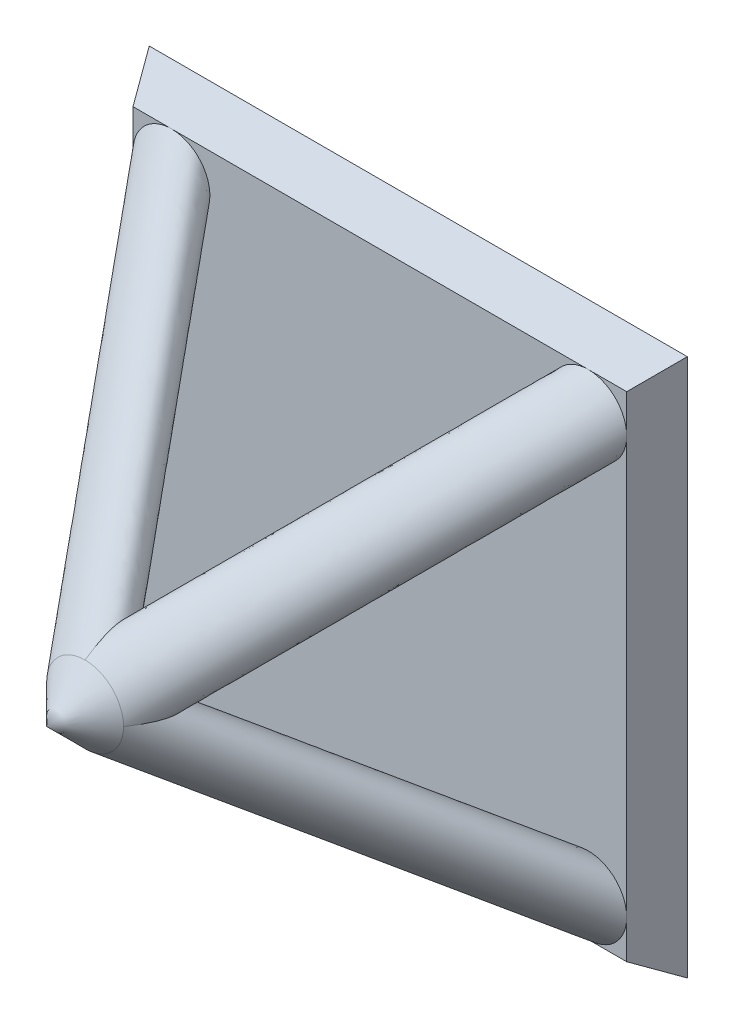
ISO-10303-21;
HEADER;
FILE_DESCRIPTION(('STEP AP214'),'2;1');
FILE_NAME('part.step','',(''),(''),'','','');
FILE_SCHEMA(('AUTOMOTIVE_DESIGN { 1 0 10303 214 1 1 1 1 }'));
ENDSEC;
DATA;
#1=APPLICATION_CONTEXT('core data for automotive mechanical design processes');
#2=APPLICATION_PROTOCOL_DEFINITION('international standard','automotive_design',2000,#1);
#3=PRODUCT_CONTEXT('',#1,'mechanical');
#4=PRODUCT('Part','Part','',(#3));
#5=PRODUCT_RELATED_PRODUCT_CATEGORY('part','',(#4));
#6=PRODUCT_DEFINITION_FORMATION('','',#4);
#7=PRODUCT_DEFINITION_CONTEXT('part definition',#1,'design');
#8=PRODUCT_DEFINITION('design','',#6,#7);
#9=PRODUCT_DEFINITION_SHAPE('','',#8);
#10=(LENGTH_UNIT() NAMED_UNIT(*) SI_UNIT(.MILLI.,.METRE.));
#11=(NAMED_UNIT(*) PLANE_ANGLE_UNIT() SI_UNIT($,.RADIAN.));
#12=(NAMED_UNIT(*) SI_UNIT($,.STERADIAN.) SOLID_ANGLE_UNIT());
#13=UNCERTAINTY_MEASURE_WITH_UNIT(LENGTH_MEASURE(1.E-05),#10,'distance_accuracy_value','');
#14=(GEOMETRIC_REPRESENTATION_CONTEXT(3) GLOBAL_UNCERTAINTY_ASSIGNED_CONTEXT((#13)) GLOBAL_UNIT_ASSIGNED_CONTEXT((#10,
#11,#12)) REPRESENTATION_CONTEXT('',''));
#15=CARTESIAN_POINT('',(0.,0.,0.));
#16=DIRECTION('',(0.,0.,1.));
#17=DIRECTION('',(1.,0.,0.));
#18=AXIS2_PLACEMENT_3D('',#15,#16,#17);
#19=CARTESIAN_POINT('',(0.,0.,1.43977497796458));
#20=DIRECTION('',(0.,0.,1.));
#21=DIRECTION('',(1.,0.,0.));
#22=AXIS2_PLACEMENT_3D('',#19,#20,#21);
#23=PLANE('',#22);
#24=DIRECTION('',(-1.,0.,0.));
#25=VECTOR('',#24,1.);
#26=CARTESIAN_POINT('',(-3.5,-3.21132486540519,1.43977497796458));
#27=LINE('',#26,#25);
#28=CARTESIAN_POINT('',(-2.71132486540518,-3.21132486540519,1.43977497796458));
#29=VERTEX_POINT('',#28);
#30=CARTESIAN_POINT('',(2.71132486540522,-3.21132486540519,1.43977497796458));
#31=VERTEX_POINT('',#30);
#32=EDGE_CURVE('E255',#29,#31,#27,.F.);
#33=ORIENTED_EDGE('',*,*,#32,.T.);
#34=CARTESIAN_POINT('',(2.71132486540522,-2.71132486540516,1.43977497796458));
#35=DIRECTION('',(0.,0.,1.));
#36=DIRECTION('',(0.,-1.,0.));
#37=AXIS2_PLACEMENT_3D('',#34,#35,#36);
#38=CIRCLE('',#37,0.5);
#39=CARTESIAN_POINT('',(3.21132486540519,-2.71132486540516,1.43977497796458));
#40=VERTEX_POINT('',#39);
#41=EDGE_CURVE('E53',#40,#31,#38,.T.);
#42=ORIENTED_EDGE('',*,*,#41,.F.);
#43=DIRECTION('',(0.,-1.,0.));
#44=VECTOR('',#43,1.);
#45=CARTESIAN_POINT('',(3.21132486540519,3.49999999999999,1.43977497796458));
#46=LINE('',#45,#44);
#47=CARTESIAN_POINT('',(3.21132486540519,2.71132486540518,1.43977497796458));
#48=VERTEX_POINT('',#47);
#49=EDGE_CURVE('E260',#40,#48,#46,.F.);
#50=ORIENTED_EDGE('',*,*,#49,.T.);
#51=CARTESIAN_POINT('',(2.71132486540519,2.71132486540518,1.43977497796458));
#52=DIRECTION('',(0.,0.,1.));
#53=DIRECTION('',(1.,0.,0.));
#54=AXIS2_PLACEMENT_3D('',#51,#52,#53);
#55=CIRCLE('',#54,0.5);
#56=CARTESIAN_POINT('',(2.71132486540519,3.21132486540518,1.43977497796458));
#57=VERTEX_POINT('',#56);
#58=EDGE_CURVE('E151',#57,#48,#55,.T.);
#59=ORIENTED_EDGE('',*,*,#58,.F.);
#60=DIRECTION('',(1.,0.,0.));
#61=VECTOR('',#60,1.);
#62=CARTESIAN_POINT('',(-3.5,3.21132486540518,1.43977497796458));
#63=LINE('',#62,#61);
#64=CARTESIAN_POINT('',(-2.71132486540519,3.21132486540518,1.43977497796458));
#65=VERTEX_POINT('',#64);
#66=EDGE_CURVE('E261',#57,#65,#63,.F.);
#67=ORIENTED_EDGE('',*,*,#66,.T.);
#68=CARTESIAN_POINT('',(-2.71132486540519,2.71132486540517,1.43977497796458));
#69=DIRECTION('',(0.,0.,1.));
#70=DIRECTION('',(0.,1.,0.));
#71=AXIS2_PLACEMENT_3D('',#68,#69,#70);
#72=CIRCLE('',#71,0.5);
#73=CARTESIAN_POINT('',(-3.21132486540519,2.71132486540517,1.43977497796458));
#74=VERTEX_POINT('',#73);
#75=EDGE_CURVE('E173',#74,#65,#72,.T.);
#76=ORIENTED_EDGE('',*,*,#75,.F.);
#77=DIRECTION('',(0.,1.,0.));
#78=VECTOR('',#77,1.);
#79=CARTESIAN_POINT('',(-3.21132486540518,3.49999999999999,1.43977497796458));
#80=LINE('',#79,#78);
#81=CARTESIAN_POINT('',(-3.21132486540518,-2.71132486540519,1.43977497796458));
#82=VERTEX_POINT('',#81);
#83=EDGE_CURVE('E251',#74,#82,#80,.F.);
#84=ORIENTED_EDGE('',*,*,#83,.T.);
#85=CARTESIAN_POINT('',(-2.71132486540518,-2.71132486540519,1.43977497796458));
#86=DIRECTION('',(0.,0.,1.));
#87=DIRECTION('',(-1.,0.,0.));
#88=AXIS2_PLACEMENT_3D('',#85,#86,#87);
#89=CIRCLE('',#88,0.5);
#90=EDGE_CURVE('E60',#29,#82,#89,.T.);
#91=ORIENTED_EDGE('',*,*,#90,.F.);
#92=EDGE_LOOP('',(#33,#42,#50,#59,#67,#76,#84,#91));
#93=FACE_BOUND('',#92,.T.);
#94=ADVANCED_FACE('F34',(#93),#23,.T.);
#95=CARTESIAN_POINT('',(3.21132486540519,-3.21132486540519,1.43977497796458));
#96=VERTEX_POINT('',#95);
#97=EDGE_CURVE('E256',#96,#40,#46,.F.);
#98=ORIENTED_EDGE('',*,*,#97,.T.);
#99=EDGE_CURVE('E180',#31,#40,#38,.T.);
#100=ORIENTED_EDGE('',*,*,#99,.F.);
#101=EDGE_CURVE('E250',#31,#96,#27,.F.);
#102=ORIENTED_EDGE('',*,*,#101,.T.);
#103=EDGE_LOOP('',(#98,#100,#102));
#104=FACE_BOUND('',#103,.T.);
#105=ADVANCED_FACE('F195',(#104),#23,.T.);
#106=CARTESIAN_POINT('',(0.,0.,5.2741673746201));
#107=DIRECTION('',(0.,0.,1.));
#108=DIRECTION('',(1.,0.,0.));
#109=AXIS2_PLACEMENT_3D('',#106,#107,#108);
#110=CIRCLE('',#109,0.5);
#111=DIRECTION('',(0.499999999999994,0.499999999999994,-0.707106781186556));
#112=VECTOR('',#111,1.);
#113=SURFACE_OF_LINEAR_EXTRUSION('',#110,#112);
#114=EDGE_CURVE('E135',#48,#57,#55,.T.);
#115=ORIENTED_EDGE('',*,*,#114,.T.);
#116=ORIENTED_EDGE('',*,*,#58,.T.);
#117=EDGE_LOOP('',(#115,#116));
#118=FACE_BOUND('',#117,.T.);
#119=CARTESIAN_POINT('',(0.500000000000001,0.,5.2741673746201));
#120=CARTESIAN_POINT('',(0.50062675324707,0.,5.27328099882382));
#121=CARTESIAN_POINT('',(0.501252735562093,0.,5.27239406015162));
#122=CARTESIAN_POINT('',(0.525889929407019,-5.76955716540044E-13,5.23742068329452));
#123=CARTESIAN_POINT('',(0.548756796098873,-1.58493198964391E-13,5.20250350532172));
#124=CARTESIAN_POINT('',(0.591596860247958,1.47876037232493E-13,5.13091563332424));
#125=CARTESIAN_POINT('',(0.611569083470219,0.,5.09424435442858));
#126=CARTESIAN_POINT('',(0.647621755977658,0.,5.01892139973478));
#127=CARTESIAN_POINT('',(0.663698981320735,0.,4.98026811524714));
#128=CARTESIAN_POINT('',(0.685052301504126,0.,4.91530474863217));
#129=CARTESIAN_POINT('',(0.692130900180761,0.,4.88960424957993));
#130=CARTESIAN_POINT('',(0.701445313447664,0.,4.84362480554238));
#131=CARTESIAN_POINT('',(0.704431800576327,0.,4.82350694205033));
#132=CARTESIAN_POINT('',(0.707510816938238,0.,4.78308166497802));
#133=CARTESIAN_POINT('',(0.707610615789356,0.,4.762774856397));
#134=CARTESIAN_POINT('',(0.703359427322083,0.,4.72013597028804));
#135=CARTESIAN_POINT('',(0.69851684071624,0.,4.69782726589883));
#136=CARTESIAN_POINT('',(0.686422113411891,0.,4.66817615108397));
#137=CARTESIAN_POINT('',(0.68216542173902,0.,4.65961584657665));
#138=CARTESIAN_POINT('',(0.672274565263973,0.,4.64332887692559));
#139=CARTESIAN_POINT('',(0.66664172969223,0.,4.63560141764734));
#140=CARTESIAN_POINT('',(0.654054424646012,0.,4.62125582512501));
#141=CARTESIAN_POINT('',(0.64709520358528,0.,4.61464184629708));
#142=CARTESIAN_POINT('',(0.63211084333845,0.,4.60275882260466));
#143=CARTESIAN_POINT('',(0.624085043595003,0.,4.59749061716623));
#144=CARTESIAN_POINT('',(0.60578386410375,0.,4.58751954453014));
#145=CARTESIAN_POINT('',(0.595362886228318,0.,4.58308636461905));
#146=CARTESIAN_POINT('',(0.573932156943927,0.,4.57596010263918));
#147=CARTESIAN_POINT('',(0.562920726768168,0.,4.57327230169996));
#148=CARTESIAN_POINT('',(0.534380534057067,0.,4.56826830760703));
#149=CARTESIAN_POINT('',(0.516671557953081,0.,4.56701256410352));
#150=CARTESIAN_POINT('',(0.481277890880036,0.,4.56711158726383));
#151=CARTESIAN_POINT('',(0.463593350410597,0.,4.56847238854157));
#152=CARTESIAN_POINT('',(0.428967646897214,0.,4.57305403623888));
#153=CARTESIAN_POINT('',(0.412019304381491,0.,4.57622367226048));
#154=CARTESIAN_POINT('',(0.378443191581783,0.,4.58396252140178));
#155=CARTESIAN_POINT('',(0.361815667939182,0.,4.58853276902577));
#156=CARTESIAN_POINT('',(0.318955191710792,0.,4.60187316048215));
#157=CARTESIAN_POINT('',(0.292993854899259,0.,4.61151181985233));
#158=CARTESIAN_POINT('',(0.241935314727027,0.,4.63286824138885));
#159=CARTESIAN_POINT('',(0.216839057341861,0.,4.64458819841943));
#160=CARTESIAN_POINT('',(0.142958500395134,0.,4.68206378811395));
#161=CARTESIAN_POINT('',(0.0953834523850548,0.,4.71020557412761));
#162=CARTESIAN_POINT('',(0.00322295699583805,0.,4.7708376753035));
#163=CARTESIAN_POINT('',(-0.0413645736595513,0.,4.80332491188593));
#164=CARTESIAN_POINT('',(-0.127759192856723,0.,4.87177486230018));
#165=CARTESIAN_POINT('',(-0.169567001429066,0.,4.90773667014746));
#166=CARTESIAN_POINT('',(-0.250390445777819,0.,4.98266128830953));
#167=CARTESIAN_POINT('',(-0.28940630664073,0.,5.02162385617636));
#168=CARTESIAN_POINT('',(-0.3576489424362,0.,5.09504090417989));
#169=CARTESIAN_POINT('',(-0.387370433370279,-1.65085715118248E-13,5.12903731178546));
#170=CARTESIAN_POINT('',(-0.444549338825167,1.49768804303694E-13,5.19887886504551));
#171=CARTESIAN_POINT('',(-0.472007758484134,5.76720912207449E-13,5.23472317833205));
#172=CARTESIAN_POINT('',(-0.498745678449006,0.,5.27239517321525));
#173=CARTESIAN_POINT('',(-0.499373231366478,0.,5.27328100095136));
#174=CARTESIAN_POINT('',(-0.500000000000005,0.,5.27416737462011));
#175=B_SPLINE_CURVE_WITH_KNOTS('',3,(#119,#120,#121,#122,#123,#124,#125,#126,#127,#128,#129,
#130,#131,#132,#133,#134,#135,#136,#137,#138,#139,#140,#141,#142,#143,#144,#145,#146,#147,#148,
#149,#150,#151,#152,#153,#154,#155,#156,#157,#158,#159,#160,#161,#162,#163,#164,#165,#166,#167,
#168,#169,#170,#171,#172,#173,#174),.UNSPECIFIED.,.F.,.F.,(4,2,2,2,2,2,2,2,2,2,2,2,2,2,2,2,2,2,
2,2,2,2,2,2,2,2,2,4),(0.,0.00325677909396096,0.128338337519893,0.253461896713694,
0.378688671207662,0.458483146727893,0.519337824815864,0.580039237697168,0.647428734230178,
0.675994357481385,0.704532497264364,0.733174860673045,0.761835046368949,0.795621817027993,
0.829510348399808,0.882470990056937,0.935553922915851,0.987203694693896,1.03889170777678,
1.12183528329813,1.20486685335574,1.37030219793256,1.53562095283177,1.70089671707644,
1.86615914176128,2.00155072176297,2.13688184014306,2.1401386192322),.UNSPECIFIED.);
#176=CARTESIAN_POINT('',(0.,-5.48113007854951E-13,4.7741673746197));
#177=VERTEX_POINT('',#176);
#178=CARTESIAN_POINT('',(0.500000000000002,0.,5.2741673746201));
#179=VERTEX_POINT('',#178);
#180=EDGE_CURVE('E147',#177,#179,#175,.F.);
#181=ORIENTED_EDGE('',*,*,#180,.F.);
#182=CARTESIAN_POINT('',(0.,0.499999999999993,5.2741673746201));
#183=CARTESIAN_POINT('',(0.,0.500626753247062,5.27328099882382));
#184=CARTESIAN_POINT('',(0.,0.501252735562084,5.27239406015162));
#185=CARTESIAN_POINT('',(5.75133739539616E-13,0.525889929407001,5.23742068329451));
#186=CARTESIAN_POINT('',(1.55346753883243E-13,0.548756796098861,5.20250350532172));
#187=CARTESIAN_POINT('',(-1.51860170617645E-13,0.59159686024795,5.13091563332424));
#188=CARTESIAN_POINT('',(0.,0.611569083470209,5.09424435442858));
#189=CARTESIAN_POINT('',(0.,0.647621755977647,5.01892139973478));
#190=CARTESIAN_POINT('',(0.,0.663698981320723,4.98026811524714));
#191=CARTESIAN_POINT('',(0.,0.685052301504115,4.91530474863217));
#192=CARTESIAN_POINT('',(0.,0.692130900180748,4.88960424957993));
#193=CARTESIAN_POINT('',(0.,0.701445313447651,4.84362480554239));
#194=CARTESIAN_POINT('',(0.,0.704431800576315,4.82350694205034));
#195=CARTESIAN_POINT('',(0.,0.707510816938225,4.78308166497802));
#196=CARTESIAN_POINT('',(0.,0.707610615789342,4.762774856397));
#197=CARTESIAN_POINT('',(0.,0.703359427322068,4.72013597028804));
#198=CARTESIAN_POINT('',(0.,0.698516840716226,4.69782726589884));
#199=CARTESIAN_POINT('',(0.,0.686422113411877,4.66817615108397));
#200=CARTESIAN_POINT('',(0.,0.682165421739006,4.65961584657666));
#201=CARTESIAN_POINT('',(0.,0.672274565263959,4.64332887692559));
#202=CARTESIAN_POINT('',(0.,0.666641729692215,4.63560141764735));
#203=CARTESIAN_POINT('',(0.,0.654054424645998,4.62125582512501));
#204=CARTESIAN_POINT('',(0.,0.647095203585266,4.61464184629708));
#205=CARTESIAN_POINT('',(0.,0.632110843338435,4.60275882260467));
#206=CARTESIAN_POINT('',(0.,0.624085043594988,4.59749061716624));
#207=CARTESIAN_POINT('',(0.,0.605783864103734,4.58751954453014));
#208=CARTESIAN_POINT('',(0.,0.595362886228302,4.58308636461905));
#209=CARTESIAN_POINT('',(0.,0.573932156943911,4.57596010263918));
#210=CARTESIAN_POINT('',(0.,0.562920726768151,4.57327230169996));
#211=CARTESIAN_POINT('',(0.,0.534380534057049,4.56826830760703));
#212=CARTESIAN_POINT('',(0.,0.516671557953063,4.56701256410352));
#213=CARTESIAN_POINT('',(0.,0.481277890880017,4.56711158726384));
#214=CARTESIAN_POINT('',(0.,0.463593350410578,4.56847238854157));
#215=CARTESIAN_POINT('',(0.,0.428967646897194,4.57305403623888));
#216=CARTESIAN_POINT('',(0.,0.41201930438147,4.57622367226048));
#217=CARTESIAN_POINT('',(0.,0.378443191581762,4.58396252140179));
#218=CARTESIAN_POINT('',(0.,0.36181566793916,4.58853276902578));
#219=CARTESIAN_POINT('',(0.,0.318955191710769,4.60187316048216));
#220=CARTESIAN_POINT('',(0.,0.292993854899236,4.61151181985234));
#221=CARTESIAN_POINT('',(0.,0.241935314727003,4.63286824138886));
#222=CARTESIAN_POINT('',(0.,0.216839057341837,4.64458819841944));
#223=CARTESIAN_POINT('',(0.,0.142958500395109,4.68206378811396));
#224=CARTESIAN_POINT('',(0.,0.0953834523850287,4.71020557412762));
#225=CARTESIAN_POINT('',(0.,0.00322295699581043,4.77083767530351));
#226=CARTESIAN_POINT('',(0.,-0.0413645736595795,4.80332491188594));
#227=CARTESIAN_POINT('',(0.,-0.127759192856752,4.8717748623002));
#228=CARTESIAN_POINT('',(0.,-0.169567001429096,4.90773667014748));
#229=CARTESIAN_POINT('',(0.,-0.250390445777849,4.98266128830955));
#230=CARTESIAN_POINT('',(0.,-0.289406306640762,5.02162385617638));
#231=CARTESIAN_POINT('',(0.,-0.357648942436256,5.09504090417994));
#232=CARTESIAN_POINT('',(1.05048893823898E-13,-0.387370433370357,5.12903731178554));
#233=CARTESIAN_POINT('',(-1.0307395193062E-13,-0.444549338825295,5.19887886504566));
#234=CARTESIAN_POINT('',(-3.84498829955236E-13,-0.472007758484289,5.23472317833222));
#235=CARTESIAN_POINT('',(0.,-0.498745678449167,5.27239517321547));
#236=CARTESIAN_POINT('',(0.,-0.499373231366639,5.27328100095158));
#237=CARTESIAN_POINT('',(0.,-0.500000000000166,5.27416737462033));
#238=B_SPLINE_CURVE_WITH_KNOTS('',3,(#182,#183,#184,#185,#186,#187,#188,#189,#190,#191,#192,
#193,#194,#195,#196,#197,#198,#199,#200,#201,#202,#203,#204,#205,#206,#207,#208,#209,#210,#211,
#212,#213,#214,#215,#216,#217,#218,#219,#220,#221,#222,#223,#224,#225,#226,#227,#228,#229,#230,
#231,#232,#233,#234,#235,#236,#237),.UNSPECIFIED.,.F.,.F.,(4,2,2,2,2,2,2,2,2,2,2,2,2,2,2,2,2,2,
2,2,2,2,2,2,2,2,2,4),(0.,0.00325677909396034,0.128338337519892,0.253461896713692,
0.378688671207661,0.45848314672789,0.519337824815861,0.580039237697163,0.647428734230173,
0.67599435748138,0.704532497264359,0.733174860673039,0.761835046368945,0.795621817027989,
0.829510348399805,0.882470990056936,0.935553922915851,0.987203694693897,1.03889170777678,
1.12183528329813,1.20486685335575,1.37030219793257,1.53562095283178,1.70089671707645,
1.8661591417613,2.00155072176311,2.13688184014331,2.14013861923245),.UNSPECIFIED.);
#239=CARTESIAN_POINT('',(0.,0.499999999999993,5.2741673746201));
#240=VERTEX_POINT('',#239);
#241=EDGE_CURVE('E142',#240,#177,#238,.T.);
#242=ORIENTED_EDGE('',*,*,#241,.F.);
#243=EDGE_CURVE('E125',#179,#240,#110,.T.);
#244=ORIENTED_EDGE('',*,*,#243,.F.);
#245=EDGE_LOOP('',(#181,#242,#244));
#246=FACE_BOUND('',#245,.T.);
#247=ADVANCED_FACE('F146',(#118,#246),#113,.F.);
#248=CARTESIAN_POINT('',(0.,0.,5.2741673746201));
#249=DIRECTION('',(0.,0.,1.));
#250=DIRECTION('',(-1.,0.,0.));
#251=AXIS2_PLACEMENT_3D('',#248,#249,#250);
#252=CIRCLE('',#251,0.5);
#253=DIRECTION('',(-0.499999999999994,-0.499999999999994,-0.707106781186556));
#254=VECTOR('',#253,1.);
#255=SURFACE_OF_LINEAR_EXTRUSION('',#252,#254);
#256=EDGE_CURVE('E172',#82,#29,#89,.T.);
#257=ORIENTED_EDGE('',*,*,#256,.T.);
#258=ORIENTED_EDGE('',*,*,#90,.T.);
#259=EDGE_LOOP('',(#257,#258));
#260=FACE_BOUND('',#259,.T.);
#261=CARTESIAN_POINT('',(0.,-0.500000000000007,5.2741673746201));
#262=CARTESIAN_POINT('',(0.,-0.500626753247076,5.27328099882382));
#263=CARTESIAN_POINT('',(0.,-0.501252735562098,5.27239406015162));
#264=CARTESIAN_POINT('',(-3.79279296654962E-13,-0.525889929407015,5.23742068329451));
#265=CARTESIAN_POINT('',(-1.00217091057653E-13,-0.548756796098876,5.20250350532172));
#266=CARTESIAN_POINT('',(1.04846763951492E-13,-0.591596860247965,5.13091563332424));
#267=CARTESIAN_POINT('',(0.,-0.611569083470223,5.09424435442858));
#268=CARTESIAN_POINT('',(0.,-0.647621755977661,5.01892139973478));
#269=CARTESIAN_POINT('',(0.,-0.663698981320737,4.98026811524714));
#270=CARTESIAN_POINT('',(0.,-0.685052301504128,4.91530474863217));
#271=CARTESIAN_POINT('',(0.,-0.692130900180762,4.88960424957993));
#272=CARTESIAN_POINT('',(0.,-0.701445313447664,4.84362480554239));
#273=CARTESIAN_POINT('',(0.,-0.704431800576327,4.82350694205034));
#274=CARTESIAN_POINT('',(0.,-0.707510816938237,4.78308166497802));
#275=CARTESIAN_POINT('',(0.,-0.707610615789354,4.762774856397));
#276=CARTESIAN_POINT('',(0.,-0.70335942732208,4.72013597028804));
#277=CARTESIAN_POINT('',(0.,-0.698516840716237,4.69782726589884));
#278=CARTESIAN_POINT('',(0.,-0.686422113411887,4.66817615108397));
#279=CARTESIAN_POINT('',(0.,-0.682165421739016,4.65961584657666));
#280=CARTESIAN_POINT('',(0.,-0.672274565263968,4.64332887692559));
#281=CARTESIAN_POINT('',(0.,-0.666641729692225,4.63560141764735));
#282=CARTESIAN_POINT('',(0.,-0.654054424646007,4.62125582512501));
#283=CARTESIAN_POINT('',(0.,-0.647095203585275,4.61464184629709));
#284=CARTESIAN_POINT('',(0.,-0.632110843338444,4.60275882260467));
#285=CARTESIAN_POINT('',(0.,-0.624085043594998,4.59749061716624));
#286=CARTESIAN_POINT('',(0.,-0.605783864103743,4.58751954453014));
#287=CARTESIAN_POINT('',(0.,-0.595362886228311,4.58308636461905));
#288=CARTESIAN_POINT('',(0.,-0.573932156943919,4.57596010263918));
#289=CARTESIAN_POINT('',(0.,-0.562920726768159,4.57327230169996));
#290=CARTESIAN_POINT('',(0.,-0.534380534057056,4.56826830760703));
#291=CARTESIAN_POINT('',(0.,-0.516671557953069,4.56701256410352));
#292=CARTESIAN_POINT('',(0.,-0.481277890880022,4.56711158726384));
#293=CARTESIAN_POINT('',(0.,-0.463593350410583,4.56847238854158));
#294=CARTESIAN_POINT('',(0.,-0.428967646897198,4.57305403623888));
#295=CARTESIAN_POINT('',(0.,-0.412019304381474,4.57622367226049));
#296=CARTESIAN_POINT('',(0.,-0.378443191581765,4.58396252140179));
#297=CARTESIAN_POINT('',(0.,-0.361815667939162,4.58853276902578));
#298=CARTESIAN_POINT('',(0.,-0.31895519171077,4.60187316048216));
#299=CARTESIAN_POINT('',(0.,-0.292993854899236,4.61151181985235));
#300=CARTESIAN_POINT('',(0.,-0.241935314727001,4.63286824138887));
#301=CARTESIAN_POINT('',(0.,-0.216839057341835,4.64458819841945));
#302=CARTESIAN_POINT('',(0.,-0.142958500395104,4.68206378811397));
#303=CARTESIAN_POINT('',(0.,-0.095383452385023,4.71020557412764));
#304=CARTESIAN_POINT('',(0.,-0.00322295699580224,4.77083767530353));
#305=CARTESIAN_POINT('',(0.,0.041364573659589,4.80332491188596));
#306=CARTESIAN_POINT('',(0.,0.127759192856764,4.87177486230022));
#307=CARTESIAN_POINT('',(0.,0.169567001429108,4.9077366701475));
#308=CARTESIAN_POINT('',(0.,0.250390445777864,4.98266128830957));
#309=CARTESIAN_POINT('',(1.22427386845128E-13,0.289406306640777,5.02162385617641));
#310=CARTESIAN_POINT('',(0.,0.357648942436266,5.09504090417997));
#311=CARTESIAN_POINT('',(-3.41303520939152E-13,0.387370433370363,5.12903731178556));
#312=CARTESIAN_POINT('',(3.39747913364332E-13,0.444549338825288,5.19887886504567));
#313=CARTESIAN_POINT('',(1.26324385895865E-12,0.472007758484276,5.23472317833223));
#314=CARTESIAN_POINT('',(0.,0.498745678449153,5.27239517321547));
#315=CARTESIAN_POINT('',(0.,0.499373231366625,5.27328100095158));
#316=CARTESIAN_POINT('',(0.,0.500000000000152,5.27416737462033));
#317=B_SPLINE_CURVE_WITH_KNOTS('',3,(#261,#262,#263,#264,#265,#266,#267,#268,#269,#270,#271,
#272,#273,#274,#275,#276,#277,#278,#279,#280,#281,#282,#283,#284,#285,#286,#287,#288,#289,#290,
#291,#292,#293,#294,#295,#296,#297,#298,#299,#300,#301,#302,#303,#304,#305,#306,#307,#308,#309,
#310,#311,#312,#313,#314,#315,#316),.UNSPECIFIED.,.F.,.F.,(4,2,2,2,2,2,2,2,2,2,2,2,2,2,2,2,2,2,
2,2,2,2,2,2,2,2,2,4),(0.,0.00325677909396034,0.128338337519892,0.253461896713693,
0.378688671207663,0.45848314672789,0.519337824815861,0.580039237697163,0.647428734230173,
0.67599435748138,0.704532497264358,0.733174860673038,0.761835046368944,0.795621817027989,
0.829510348399805,0.882470990056938,0.935553922915854,0.987203694693901,1.03889170777678,
1.12183528329814,1.20486685335576,1.37030219793259,1.53562095283181,1.70089671707648,
1.86615914176134,2.00155072176312,2.1368818401433,2.14013861923245),.UNSPECIFIED.);
#318=CARTESIAN_POINT('',(0.,-0.500000000000007,5.2741673746201));
#319=VERTEX_POINT('',#318);
#320=EDGE_CURVE('E11',#319,#177,#317,.T.);
#321=ORIENTED_EDGE('',*,*,#320,.F.);
#322=CARTESIAN_POINT('',(-0.499999999999999,0.,5.2741673746201));
#323=VERTEX_POINT('',#322);
#324=EDGE_CURVE('E137',#323,#319,#110,.T.);
#325=ORIENTED_EDGE('',*,*,#324,.F.);
#326=CARTESIAN_POINT('',(-0.499999999999999,0.,5.2741673746201));
#327=CARTESIAN_POINT('',(-0.500626753247067,0.,5.27328099882382));
#328=CARTESIAN_POINT('',(-0.50125273556209,0.,5.27239406015162));
#329=CARTESIAN_POINT('',(-0.525889929407006,5.65665402982434E-13,5.23742068329451));
#330=CARTESIAN_POINT('',(-0.548756796098867,1.46170258099784E-13,5.20250350532172));
#331=CARTESIAN_POINT('',(-0.591596860247956,-1.60630847376428E-13,5.13091563332424));
#332=CARTESIAN_POINT('',(-0.611569083470215,0.,5.09424435442858));
#333=CARTESIAN_POINT('',(-0.647621755977653,0.,5.01892139973478));
#334=CARTESIAN_POINT('',(-0.66369898132073,0.,4.98026811524714));
#335=CARTESIAN_POINT('',(-0.685052301504121,0.,4.91530474863217));
#336=CARTESIAN_POINT('',(-0.692130900180755,0.,4.88960424957993));
#337=CARTESIAN_POINT('',(-0.701445313447659,0.,4.84362480554239));
#338=CARTESIAN_POINT('',(-0.704431800576322,0.,4.82350694205033));
#339=CARTESIAN_POINT('',(-0.707510816938233,0.,4.78308166497802));
#340=CARTESIAN_POINT('',(-0.70761061578935,0.,4.762774856397));
#341=CARTESIAN_POINT('',(-0.703359427322077,0.,4.72013597028804));
#342=CARTESIAN_POINT('',(-0.698516840716234,0.,4.69782726589884));
#343=CARTESIAN_POINT('',(-0.686422113411885,0.,4.66817615108397));
#344=CARTESIAN_POINT('',(-0.682165421739014,0.,4.65961584657665));
#345=CARTESIAN_POINT('',(-0.672274565263967,0.,4.64332887692559));
#346=CARTESIAN_POINT('',(-0.666641729692224,0.,4.63560141764734));
#347=CARTESIAN_POINT('',(-0.654054424646006,0.,4.62125582512501));
#348=CARTESIAN_POINT('',(-0.647095203585275,0.,4.61464184629708));
#349=CARTESIAN_POINT('',(-0.632110843338444,0.,4.60275882260467));
#350=CARTESIAN_POINT('',(-0.624085043594997,0.,4.59749061716623));
#351=CARTESIAN_POINT('',(-0.605783864103743,0.,4.58751954453014));
#352=CARTESIAN_POINT('',(-0.595362886228311,0.,4.58308636461905));
#353=CARTESIAN_POINT('',(-0.57393215694392,0.,4.57596010263918));
#354=CARTESIAN_POINT('',(-0.562920726768161,0.,4.57327230169996));
#355=CARTESIAN_POINT('',(-0.534380534057059,0.,4.56826830760703));
#356=CARTESIAN_POINT('',(-0.516671557953073,0.,4.56701256410352));
#357=CARTESIAN_POINT('',(-0.481277890880027,0.,4.56711158726383));
#358=CARTESIAN_POINT('',(-0.463593350410589,0.,4.56847238854157));
#359=CARTESIAN_POINT('',(-0.428967646897205,0.,4.57305403623888));
#360=CARTESIAN_POINT('',(-0.412019304381482,0.,4.57622367226048));
#361=CARTESIAN_POINT('',(-0.378443191581774,0.,4.58396252140179));
#362=CARTESIAN_POINT('',(-0.361815667939172,0.,4.58853276902578));
#363=CARTESIAN_POINT('',(-0.318955191710782,0.,4.60187316048216));
#364=CARTESIAN_POINT('',(-0.292993854899248,0.,4.61151181985233));
#365=CARTESIAN_POINT('',(-0.241935314727016,0.,4.63286824138885));
#366=CARTESIAN_POINT('',(-0.21683905734185,0.,4.64458819841943));
#367=CARTESIAN_POINT('',(-0.142958500395122,0.,4.68206378811395));
#368=CARTESIAN_POINT('',(-0.0953834523850429,0.,4.71020557412762));
#369=CARTESIAN_POINT('',(-0.00322295699582511,0.,4.77083767530351));
#370=CARTESIAN_POINT('',(0.0413645736595648,0.,4.80332491188593));
#371=CARTESIAN_POINT('',(0.127759192856737,0.,4.87177486230019));
#372=CARTESIAN_POINT('',(0.16956700142908,0.,4.90773667014747));
#373=CARTESIAN_POINT('',(0.250390445777833,0.,4.98266128830954));
#374=CARTESIAN_POINT('',(0.289406306640746,0.,5.02162385617637));
#375=CARTESIAN_POINT('',(0.357648942436242,0.,5.09504090417993));
#376=CARTESIAN_POINT('',(0.387370433370346,2.29555660854199E-13,5.12903731178553));
#377=CARTESIAN_POINT('',(0.444549338825285,-2.44054736542971E-13,5.19887886504565));
#378=CARTESIAN_POINT('',(0.472007758484279,-8.84285824385607E-13,5.23472317833222));
#379=CARTESIAN_POINT('',(0.498745678449162,0.,5.27239517321547));
#380=CARTESIAN_POINT('',(0.499373231366634,0.,5.27328100095158));
#381=CARTESIAN_POINT('',(0.500000000000161,0.,5.27416737462033));
#382=B_SPLINE_CURVE_WITH_KNOTS('',3,(#326,#327,#328,#329,#330,#331,#332,#333,#334,#335,#336,
#337,#338,#339,#340,#341,#342,#343,#344,#345,#346,#347,#348,#349,#350,#351,#352,#353,#354,#355,
#356,#357,#358,#359,#360,#361,#362,#363,#364,#365,#366,#367,#368,#369,#370,#371,#372,#373,#374,
#375,#376,#377,#378,#379,#380,#381),.UNSPECIFIED.,.F.,.F.,(4,2,2,2,2,2,2,2,2,2,2,2,2,2,2,2,2,2,
2,2,2,2,2,2,2,2,2,4),(0.,0.00325677909396034,0.128338337519891,0.253461896713692,
0.37868867120766,0.458483146727891,0.519337824815863,0.580039237697165,0.647428734230175,
0.675994357481382,0.704532497264361,0.733174860673041,0.761835046368947,0.79562181702799,
0.829510348399806,0.882470990056936,0.93555392291585,0.987203694693896,1.03889170777678,
1.12183528329813,1.20486685335574,1.37030219793256,1.53562095283178,1.70089671707645,
1.86615914176129,2.00155072176311,2.13688184014331,2.14013861923246),.UNSPECIFIED.);
#383=EDGE_CURVE('E47',#323,#177,#382,.T.);
#384=ORIENTED_EDGE('',*,*,#383,.T.);
#385=EDGE_LOOP('',(#321,#325,#384));
#386=FACE_BOUND('',#385,.T.);
#387=ADVANCED_FACE('F166',(#260,#386),#255,.F.);
#388=CARTESIAN_POINT('',(-3.21132486540518,-3.21132486540519,1.43977497796458));
#389=VERTEX_POINT('',#388);
#390=EDGE_CURVE('E252',#389,#29,#27,.F.);
#391=ORIENTED_EDGE('',*,*,#390,.T.);
#392=ORIENTED_EDGE('',*,*,#256,.F.);
#393=EDGE_CURVE('E237',#82,#389,#80,.F.);
#394=ORIENTED_EDGE('',*,*,#393,.T.);
#395=EDGE_LOOP('',(#391,#392,#394));
#396=FACE_BOUND('',#395,.T.);
#397=ADVANCED_FACE('F164',(#396),#23,.T.);
#398=CARTESIAN_POINT('',(0.,0.,5.2741673746201));
#399=DIRECTION('',(0.,0.,1.));
#400=DIRECTION('',(0.,1.,0.));
#401=AXIS2_PLACEMENT_3D('',#398,#399,#400);
#402=CIRCLE('',#401,0.5);
#403=DIRECTION('',(-0.499999999999996,0.499999999999992,-0.707106781186556));
#404=VECTOR('',#403,1.);
#405=SURFACE_OF_LINEAR_EXTRUSION('',#402,#404);
#406=EDGE_CURVE('E144',#65,#74,#72,.T.);
#407=ORIENTED_EDGE('',*,*,#406,.T.);
#408=ORIENTED_EDGE('',*,*,#75,.T.);
#409=EDGE_LOOP('',(#407,#408));
#410=FACE_BOUND('',#409,.T.);
#411=ORIENTED_EDGE('',*,*,#383,.F.);
#412=EDGE_CURVE('E127',#240,#323,#402,.T.);
#413=ORIENTED_EDGE('',*,*,#412,.F.);
#414=ORIENTED_EDGE('',*,*,#241,.T.);
#415=EDGE_LOOP('',(#411,#413,#414));
#416=FACE_BOUND('',#415,.T.);
#417=ADVANCED_FACE('F141',(#410,#416),#405,.F.);
#418=CARTESIAN_POINT('',(-3.21132486540518,3.21132486540518,1.43977497796458));
#419=VERTEX_POINT('',#418);
#420=EDGE_CURVE('E247',#419,#74,#80,.F.);
#421=ORIENTED_EDGE('',*,*,#420,.T.);
#422=ORIENTED_EDGE('',*,*,#406,.F.);
#423=EDGE_CURVE('E259',#65,#419,#63,.F.);
#424=ORIENTED_EDGE('',*,*,#423,.T.);
#425=EDGE_LOOP('',(#421,#422,#424));
#426=FACE_BOUND('',#425,.T.);
#427=ADVANCED_FACE('F163',(#426),#23,.T.);
#428=ORIENTED_EDGE('',*,*,#114,.F.);
#429=CARTESIAN_POINT('',(3.21132486540519,3.21132486540518,1.43977497796458));
#430=VERTEX_POINT('',#429);
#431=EDGE_CURVE('E217',#48,#430,#46,.F.);
#432=ORIENTED_EDGE('',*,*,#431,.T.);
#433=EDGE_CURVE('E220',#430,#57,#63,.F.);
#434=ORIENTED_EDGE('',*,*,#433,.T.);
#435=EDGE_LOOP('',(#428,#432,#434));
#436=FACE_BOUND('',#435,.T.);
#437=ADVANCED_FACE('F197',(#436),#23,.T.);
#438=CARTESIAN_POINT('',(-3.5,3.49999999999999,0.939774977964584));
#439=DIRECTION('',(-0.866025403784438,0.,0.500000000000001));
#440=DIRECTION('',(0.500000000000001,0.,0.866025403784438));
#441=AXIS2_PLACEMENT_3D('',#438,#439,#440);
#442=PLANE('',#441);
#443=DIRECTION('',(0.,-1.,0.));
#444=VECTOR('',#443,1.);
#445=CARTESIAN_POINT('',(-3.5,3.49999999999999,0.939774977964584));
#446=LINE('',#445,#444);
#447=CARTESIAN_POINT('',(-3.5,3.49999999999999,0.939774977964584));
#448=VERTEX_POINT('',#447);
#449=CARTESIAN_POINT('',(-3.5,-3.50000000000001,0.939774977964584));
#450=VERTEX_POINT('',#449);
#451=EDGE_CURVE('E229',#448,#450,#446,.T.);
#452=ORIENTED_EDGE('',*,*,#451,.T.);
#453=DIRECTION('',(-0.447213595499959,-0.447213595499959,-0.774596669241483));
#454=VECTOR('',#453,1.);
#455=CARTESIAN_POINT('',(-3.5,-3.50000000000001,0.939774977964584));
#456=LINE('',#455,#454);
#457=EDGE_CURVE('E224',#389,#450,#456,.T.);
#458=ORIENTED_EDGE('',*,*,#457,.F.);
#459=ORIENTED_EDGE('',*,*,#393,.F.);
#460=ORIENTED_EDGE('',*,*,#83,.F.);
#461=ORIENTED_EDGE('',*,*,#420,.F.);
#462=DIRECTION('',(-0.447213595499959,0.447213595499959,-0.774596669241483));
#463=VECTOR('',#462,1.);
#464=CARTESIAN_POINT('',(-3.5,3.49999999999999,0.939774977964584));
#465=LINE('',#464,#463);
#466=EDGE_CURVE('E239',#419,#448,#465,.T.);
#467=ORIENTED_EDGE('',*,*,#466,.T.);
#468=EDGE_LOOP('',(#452,#458,#459,#460,#461,#467));
#469=FACE_BOUND('',#468,.T.);
#470=ADVANCED_FACE('F204',(#469),#442,.T.);
#471=CARTESIAN_POINT('',(-3.5,-3.50000000000001,0.939774977964584));
#472=DIRECTION('',(0.,-0.866025403784438,0.500000000000001));
#473=DIRECTION('',(0.,-0.500000000000001,-0.866025403784438));
#474=AXIS2_PLACEMENT_3D('',#471,#472,#473);
#475=PLANE('',#474);
#476=DIRECTION('',(1.,0.,0.));
#477=VECTOR('',#476,1.);
#478=CARTESIAN_POINT('',(-3.5,-3.50000000000001,0.939774977964584));
#479=LINE('',#478,#477);
#480=CARTESIAN_POINT('',(3.5,-3.50000000000001,0.939774977964584));
#481=VERTEX_POINT('',#480);
#482=EDGE_CURVE('E232',#450,#481,#479,.T.);
#483=ORIENTED_EDGE('',*,*,#482,.T.);
#484=DIRECTION('',(0.447213595499959,-0.447213595499959,-0.774596669241483));
#485=VECTOR('',#484,1.);
#486=CARTESIAN_POINT('',(2.1,-2.1,3.36464610856101));
#487=LINE('',#486,#485);
#488=EDGE_CURVE('E226',#96,#481,#487,.T.);
#489=ORIENTED_EDGE('',*,*,#488,.F.);
#490=ORIENTED_EDGE('',*,*,#101,.F.);
#491=ORIENTED_EDGE('',*,*,#32,.F.);
#492=ORIENTED_EDGE('',*,*,#390,.F.);
#493=ORIENTED_EDGE('',*,*,#457,.T.);
#494=EDGE_LOOP('',(#483,#489,#490,#491,#492,#493));
#495=FACE_BOUND('',#494,.T.);
#496=ADVANCED_FACE('F36',(#495),#475,.T.);
#497=CARTESIAN_POINT('',(3.5,3.49999999999999,0.939774977964584));
#498=DIRECTION('',(0.866025403784438,0.,0.500000000000001));
#499=DIRECTION('',(0.500000000000001,0.,-0.866025403784438));
#500=AXIS2_PLACEMENT_3D('',#497,#498,#499);
#501=PLANE('',#500);
#502=DIRECTION('',(0.,1.,0.));
#503=VECTOR('',#502,1.);
#504=CARTESIAN_POINT('',(3.5,3.49999999999999,0.939774977964584));
#505=LINE('',#504,#503);
#506=CARTESIAN_POINT('',(3.5,3.49999999999999,0.939774977964584));
#507=VERTEX_POINT('',#506);
#508=EDGE_CURVE('E234',#481,#507,#505,.T.);
#509=ORIENTED_EDGE('',*,*,#508,.T.);
#510=DIRECTION('',(0.447213595499959,0.447213595499959,-0.774596669241483));
#511=VECTOR('',#510,1.);
#512=CARTESIAN_POINT('',(2.1,2.09999999999999,3.36464610856101));
#513=LINE('',#512,#511);
#514=EDGE_CURVE('E242',#430,#507,#513,.T.);
#515=ORIENTED_EDGE('',*,*,#514,.F.);
#516=ORIENTED_EDGE('',*,*,#431,.F.);
#517=ORIENTED_EDGE('',*,*,#49,.F.);
#518=ORIENTED_EDGE('',*,*,#97,.F.);
#519=ORIENTED_EDGE('',*,*,#488,.T.);
#520=EDGE_LOOP('',(#509,#515,#516,#517,#518,#519));
#521=FACE_BOUND('',#520,.T.);
#522=ADVANCED_FACE('F286',(#521),#501,.T.);
#523=CARTESIAN_POINT('',(-3.5,3.49999999999999,0.939774977964584));
#524=DIRECTION('',(0.,0.866025403784438,0.500000000000001));
#525=DIRECTION('',(0.,-0.500000000000001,0.866025403784438));
#526=AXIS2_PLACEMENT_3D('',#523,#524,#525);
#527=PLANE('',#526);
#528=DIRECTION('',(-1.,0.,0.));
#529=VECTOR('',#528,1.);
#530=CARTESIAN_POINT('',(-3.5,3.49999999999999,0.939774977964584));
#531=LINE('',#530,#529);
#532=EDGE_CURVE('E236',#507,#448,#531,.T.);
#533=ORIENTED_EDGE('',*,*,#532,.T.);
#534=ORIENTED_EDGE('',*,*,#466,.F.);
#535=ORIENTED_EDGE('',*,*,#423,.F.);
#536=ORIENTED_EDGE('',*,*,#66,.F.);
#537=ORIENTED_EDGE('',*,*,#433,.F.);
#538=ORIENTED_EDGE('',*,*,#514,.T.);
#539=EDGE_LOOP('',(#533,#534,#535,#536,#537,#538));
#540=FACE_BOUND('',#539,.T.);
#541=ADVANCED_FACE('F190',(#540),#527,.T.);
#542=CARTESIAN_POINT('',(0.,0.,0.939774977964584));
#543=DIRECTION('',(0.,0.,1.));
#544=DIRECTION('',(1.,0.,0.));
#545=AXIS2_PLACEMENT_3D('',#542,#543,#544);
#546=PLANE('',#545);
#547=ORIENTED_EDGE('',*,*,#451,.F.);
#548=ORIENTED_EDGE('',*,*,#532,.F.);
#549=ORIENTED_EDGE('',*,*,#508,.F.);
#550=ORIENTED_EDGE('',*,*,#482,.F.);
#551=EDGE_LOOP('',(#547,#548,#549,#550));
#552=FACE_BOUND('',#551,.T.);
#553=ADVANCED_FACE('F184',(#552),#546,.F.);
#554=CARTESIAN_POINT('',(0.,0.,5.2741673746201));
#555=DIRECTION('',(0.,0.,1.));
#556=DIRECTION('',(0.,-1.,0.));
#557=AXIS2_PLACEMENT_3D('',#554,#555,#556);
#558=CIRCLE('',#557,0.5);
#559=DIRECTION('',(0.499999999999999,-0.499999999999989,-0.707106781186556));
#560=VECTOR('',#559,1.);
#561=SURFACE_OF_LINEAR_EXTRUSION('',#558,#560);
#562=ORIENTED_EDGE('',*,*,#99,.T.);
#563=ORIENTED_EDGE('',*,*,#41,.T.);
#564=EDGE_LOOP('',(#562,#563));
#565=FACE_BOUND('',#564,.T.);
#566=ORIENTED_EDGE('',*,*,#320,.T.);
#567=ORIENTED_EDGE('',*,*,#180,.T.);
#568=EDGE_CURVE('E130',#319,#179,#110,.T.);
#569=ORIENTED_EDGE('',*,*,#568,.F.);
#570=EDGE_LOOP('',(#566,#567,#569));
#571=FACE_BOUND('',#570,.T.);
#572=ADVANCED_FACE('F122',(#565,#571),#561,.F.);
#573=CARTESIAN_POINT('',(0.,0.,5.2741673746201));
#574=DIRECTION('',(0.,0.,-1.));
#575=DIRECTION('',(1.,0.,0.));
#576=AXIS2_PLACEMENT_3D('',#573,#574,#575);
#577=CONICAL_SURFACE('',#576,0.5,0.78539816339745);
#578=CARTESIAN_POINT('',(0.,0.,5.7741673746201));
#579=VERTEX_POINT('',#578);
#580=VERTEX_LOOP('',#579);
#581=FACE_BOUND('',#580,.T.);
#582=ORIENTED_EDGE('',*,*,#243,.T.);
#583=ORIENTED_EDGE('',*,*,#412,.T.);
#584=ORIENTED_EDGE('',*,*,#324,.T.);
#585=ORIENTED_EDGE('',*,*,#568,.T.);
#586=EDGE_LOOP('',(#582,#583,#584,#585));
#587=FACE_BOUND('',#586,.T.);
#588=ADVANCED_FACE('F119',(#581,#587),#577,.T.);
#589=CLOSED_SHELL('',(#94,#105,#247,#387,#397,#417,#427,#437,#470,#496,#522,#541,#553,#572,#588));
#590=MANIFOLD_SOLID_BREP('B2',#589);
#591=ADVANCED_BREP_SHAPE_REPRESENTATION('',(#18,#590),#14);
#592=SHAPE_DEFINITION_REPRESENTATION(#9,#591);
ENDSEC;
END-ISO-10303-21;
